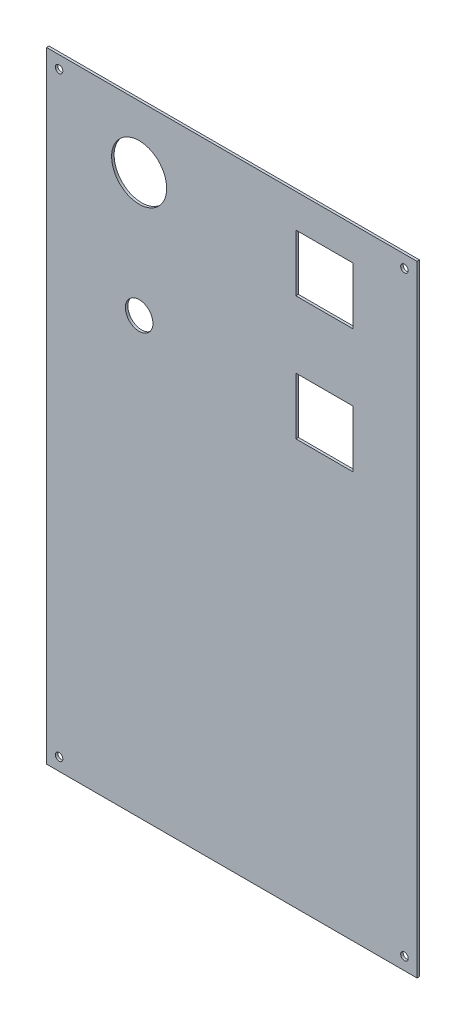
ISO-10303-21;
HEADER;
FILE_DESCRIPTION(('STEP AP214'),'2;1');
FILE_NAME('part.step','',(''),(''),'','','');
FILE_SCHEMA(('AUTOMOTIVE_DESIGN { 1 0 10303 214 1 1 1 1 }'));
ENDSEC;
DATA;
#1=APPLICATION_CONTEXT('core data for automotive mechanical design processes');
#2=APPLICATION_PROTOCOL_DEFINITION('international standard','automotive_design',2000,#1);
#3=PRODUCT_CONTEXT('',#1,'mechanical');
#4=PRODUCT('Part','Part','',(#3));
#5=PRODUCT_RELATED_PRODUCT_CATEGORY('part','',(#4));
#6=PRODUCT_DEFINITION_FORMATION('','',#4);
#7=PRODUCT_DEFINITION_CONTEXT('part definition',#1,'design');
#8=PRODUCT_DEFINITION('design','',#6,#7);
#9=PRODUCT_DEFINITION_SHAPE('','',#8);
#10=(LENGTH_UNIT() NAMED_UNIT(*) SI_UNIT(.MILLI.,.METRE.));
#11=(NAMED_UNIT(*) PLANE_ANGLE_UNIT() SI_UNIT($,.RADIAN.));
#12=(NAMED_UNIT(*) SI_UNIT($,.STERADIAN.) SOLID_ANGLE_UNIT());
#13=UNCERTAINTY_MEASURE_WITH_UNIT(LENGTH_MEASURE(1.E-05),#10,'distance_accuracy_value','');
#14=(GEOMETRIC_REPRESENTATION_CONTEXT(3) GLOBAL_UNCERTAINTY_ASSIGNED_CONTEXT((#13)) GLOBAL_UNIT_ASSIGNED_CONTEXT((#10,
#11,#12)) REPRESENTATION_CONTEXT('',''));
#15=CARTESIAN_POINT('',(0.,0.,0.));
#16=DIRECTION('',(0.,0.,1.));
#17=DIRECTION('',(1.,0.,0.));
#18=AXIS2_PLACEMENT_3D('',#15,#16,#17);
#19=CARTESIAN_POINT('',(0.,0.,0.));
#20=DIRECTION('',(0.,0.,-1.));
#21=DIRECTION('',(0.,1.,0.));
#22=AXIS2_PLACEMENT_3D('',#19,#20,#21);
#23=PLANE('',#22);
#24=CARTESIAN_POINT('',(138.,-238.,0.));
#25=DIRECTION('',(0.,0.,-1.));
#26=DIRECTION('',(0.,1.,0.));
#27=AXIS2_PLACEMENT_3D('',#24,#25,#26);
#28=CIRCLE('',#27,3.00000000000003);
#29=CARTESIAN_POINT('',(138.,-235.,0.));
#30=VERTEX_POINT('',#29);
#31=EDGE_CURVE('E147',#30,#30,#28,.F.);
#32=ORIENTED_EDGE('',*,*,#31,.T.);
#33=EDGE_LOOP('',(#32));
#34=FACE_BOUND('',#33,.T.);
#35=CARTESIAN_POINT('',(138.000000000001,238.,0.));
#36=DIRECTION('',(0.,0.,-1.));
#37=DIRECTION('',(0.,1.,0.));
#38=AXIS2_PLACEMENT_3D('',#35,#36,#37);
#39=CIRCLE('',#38,3.00000000000003);
#40=CARTESIAN_POINT('',(138.000000000001,241.,0.));
#41=VERTEX_POINT('',#40);
#42=EDGE_CURVE('E153',#41,#41,#39,.F.);
#43=ORIENTED_EDGE('',*,*,#42,.T.);
#44=EDGE_LOOP('',(#43));
#45=FACE_BOUND('',#44,.T.);
#46=CARTESIAN_POINT('',(-74.,198.5,0.));
#47=DIRECTION('',(0.,0.,-1.));
#48=DIRECTION('',(0.,1.,0.));
#49=AXIS2_PLACEMENT_3D('',#46,#47,#48);
#50=CIRCLE('',#49,22.0000000000002);
#51=CARTESIAN_POINT('',(-74.,220.5,0.));
#52=VERTEX_POINT('',#51);
#53=EDGE_CURVE('E158',#52,#52,#50,.F.);
#54=ORIENTED_EDGE('',*,*,#53,.T.);
#55=EDGE_LOOP('',(#54));
#56=FACE_BOUND('',#55,.T.);
#57=DIRECTION('',(1.,0.,0.));
#58=VECTOR('',#57,1.);
#59=CARTESIAN_POINT('',(51.2500000000006,122.25,0.));
#60=LINE('',#59,#58);
#61=CARTESIAN_POINT('',(51.2500000000004,122.25,0.));
#62=VERTEX_POINT('',#61);
#63=CARTESIAN_POINT('',(96.7500000000009,122.25,0.));
#64=VERTEX_POINT('',#63);
#65=EDGE_CURVE('E184',#62,#64,#60,.T.);
#66=ORIENTED_EDGE('',*,*,#65,.F.);
#67=DIRECTION('',(0.,1.,0.));
#68=VECTOR('',#67,1.);
#69=CARTESIAN_POINT('',(51.2500000000003,76.75,0.));
#70=LINE('',#69,#68);
#71=CARTESIAN_POINT('',(51.2500000000004,76.75,0.));
#72=VERTEX_POINT('',#71);
#73=EDGE_CURVE('E182',#72,#62,#70,.T.);
#74=ORIENTED_EDGE('',*,*,#73,.F.);
#75=DIRECTION('',(-1.,0.,0.));
#76=VECTOR('',#75,1.);
#77=CARTESIAN_POINT('',(51.2500000000003,76.75,0.));
#78=LINE('',#77,#76);
#79=CARTESIAN_POINT('',(96.7500000000009,76.7499999999999,0.));
#80=VERTEX_POINT('',#79);
#81=EDGE_CURVE('E178',#80,#72,#78,.T.);
#82=ORIENTED_EDGE('',*,*,#81,.F.);
#83=DIRECTION('',(0.,-1.,0.));
#84=VECTOR('',#83,1.);
#85=CARTESIAN_POINT('',(96.7500000000009,76.75,0.));
#86=LINE('',#85,#84);
#87=EDGE_CURVE('E170',#64,#80,#86,.T.);
#88=ORIENTED_EDGE('',*,*,#87,.F.);
#89=EDGE_LOOP('',(#66,#74,#82,#88));
#90=FACE_BOUND('',#89,.T.);
#91=DIRECTION('',(1.,0.,0.));
#92=VECTOR('',#91,1.);
#93=CARTESIAN_POINT('',(51.2500000000006,221.25,0.));
#94=LINE('',#93,#92);
#95=CARTESIAN_POINT('',(51.2500000000006,221.25,0.));
#96=VERTEX_POINT('',#95);
#97=CARTESIAN_POINT('',(96.7500000000014,221.25,0.));
#98=VERTEX_POINT('',#97);
#99=EDGE_CURVE('E116',#96,#98,#94,.T.);
#100=ORIENTED_EDGE('',*,*,#99,.F.);
#101=DIRECTION('',(0.,1.,0.));
#102=VECTOR('',#101,1.);
#103=CARTESIAN_POINT('',(51.2500000000006,221.25,0.));
#104=LINE('',#103,#102);
#105=CARTESIAN_POINT('',(51.2500000000006,175.75,0.));
#106=VERTEX_POINT('',#105);
#107=EDGE_CURVE('E107',#106,#96,#104,.T.);
#108=ORIENTED_EDGE('',*,*,#107,.F.);
#109=DIRECTION('',(-1.,0.,0.));
#110=VECTOR('',#109,1.);
#111=CARTESIAN_POINT('',(51.2500000000006,175.75,0.));
#112=LINE('',#111,#110);
#113=CARTESIAN_POINT('',(96.7500000000015,175.75,0.));
#114=VERTEX_POINT('',#113);
#115=EDGE_CURVE('E102',#114,#106,#112,.T.);
#116=ORIENTED_EDGE('',*,*,#115,.F.);
#117=DIRECTION('',(0.,-1.,0.));
#118=VECTOR('',#117,1.);
#119=CARTESIAN_POINT('',(96.7500000000014,221.25,0.));
#120=LINE('',#119,#118);
#121=EDGE_CURVE('E120',#98,#114,#120,.T.);
#122=ORIENTED_EDGE('',*,*,#121,.F.);
#123=EDGE_LOOP('',(#100,#108,#116,#122));
#124=FACE_BOUND('',#123,.T.);
#125=DIRECTION('',(0.,-1.,0.));
#126=VECTOR('',#125,1.);
#127=CARTESIAN_POINT('',(148.000000000002,248.,0.));
#128=LINE('',#127,#126);
#129=CARTESIAN_POINT('',(148.000000000002,248.,0.));
#130=VERTEX_POINT('',#129);
#131=CARTESIAN_POINT('',(148.,-248.,0.));
#132=VERTEX_POINT('',#131);
#133=EDGE_CURVE('E200',#130,#132,#128,.T.);
#134=ORIENTED_EDGE('',*,*,#133,.T.);
#135=DIRECTION('',(-1.,0.,0.));
#136=VECTOR('',#135,1.);
#137=CARTESIAN_POINT('',(148.,-248.,0.));
#138=LINE('',#137,#136);
#139=CARTESIAN_POINT('',(-148.000000000003,-248.,0.));
#140=VERTEX_POINT('',#139);
#141=EDGE_CURVE('E195',#132,#140,#138,.T.);
#142=ORIENTED_EDGE('',*,*,#141,.T.);
#143=DIRECTION('',(0.,1.,0.));
#144=VECTOR('',#143,1.);
#145=CARTESIAN_POINT('',(-148.000000000002,248.,0.));
#146=LINE('',#145,#144);
#147=CARTESIAN_POINT('',(-148.000000000002,247.999999999999,0.));
#148=VERTEX_POINT('',#147);
#149=EDGE_CURVE('E186',#140,#148,#146,.T.);
#150=ORIENTED_EDGE('',*,*,#149,.T.);
#151=DIRECTION('',(1.,0.,0.));
#152=VECTOR('',#151,1.);
#153=CARTESIAN_POINT('',(148.000000000002,248.,0.));
#154=LINE('',#153,#152);
#155=EDGE_CURVE('E205',#148,#130,#154,.T.);
#156=ORIENTED_EDGE('',*,*,#155,.T.);
#157=EDGE_LOOP('',(#134,#142,#150,#156));
#158=FACE_BOUND('',#157,.T.);
#159=CARTESIAN_POINT('',(-74.,99.4999999999999,0.));
#160=DIRECTION('',(0.,0.,-1.));
#161=DIRECTION('',(0.,1.,0.));
#162=AXIS2_PLACEMENT_3D('',#159,#160,#161);
#163=CIRCLE('',#162,11.0000000000001);
#164=CARTESIAN_POINT('',(-74.,110.5,0.));
#165=VERTEX_POINT('',#164);
#166=EDGE_CURVE('E19',#165,#165,#163,.F.);
#167=ORIENTED_EDGE('',*,*,#166,.T.);
#168=EDGE_LOOP('',(#167));
#169=FACE_BOUND('',#168,.T.);
#170=CARTESIAN_POINT('',(-138.000000000002,238.,0.));
#171=DIRECTION('',(0.,0.,-1.));
#172=DIRECTION('',(0.,1.,0.));
#173=AXIS2_PLACEMENT_3D('',#170,#171,#172);
#174=CIRCLE('',#173,3.00000000000003);
#175=CARTESIAN_POINT('',(-138.000000000002,241.,0.));
#176=VERTEX_POINT('',#175);
#177=EDGE_CURVE('E156',#176,#176,#174,.F.);
#178=ORIENTED_EDGE('',*,*,#177,.T.);
#179=EDGE_LOOP('',(#178));
#180=FACE_BOUND('',#179,.T.);
#181=CARTESIAN_POINT('',(-138.000000000003,-238.,0.));
#182=DIRECTION('',(0.,0.,-1.));
#183=DIRECTION('',(0.,1.,0.));
#184=AXIS2_PLACEMENT_3D('',#181,#182,#183);
#185=CIRCLE('',#184,3.00000000000003);
#186=CARTESIAN_POINT('',(-138.000000000003,-235.,0.));
#187=VERTEX_POINT('',#186);
#188=EDGE_CURVE('E150',#187,#187,#185,.F.);
#189=ORIENTED_EDGE('',*,*,#188,.T.);
#190=EDGE_LOOP('',(#189));
#191=FACE_BOUND('',#190,.T.);
#192=ADVANCED_FACE('F16',(#34,#45,#56,#90,#124,#158,#169,#180,#191),#23,.T.);
#193=CARTESIAN_POINT('',(51.2500000000006,221.25,2.));
#194=DIRECTION('',(0.,-1.,0.));
#195=DIRECTION('',(1.,0.,0.));
#196=AXIS2_PLACEMENT_3D('',#193,#194,#195);
#197=PLANE('',#196);
#198=DIRECTION('',(1.,0.,0.));
#199=VECTOR('',#198,1.);
#200=CARTESIAN_POINT('',(0.,221.25,2.));
#201=LINE('',#200,#199);
#202=CARTESIAN_POINT('',(96.7500000000014,221.25,2.));
#203=VERTEX_POINT('',#202);
#204=CARTESIAN_POINT('',(51.2500000000006,221.25,2.));
#205=VERTEX_POINT('',#204);
#206=EDGE_CURVE('E127',#203,#205,#201,.F.);
#207=ORIENTED_EDGE('',*,*,#206,.T.);
#208=DIRECTION('',(0.,0.,1.));
#209=VECTOR('',#208,1.);
#210=CARTESIAN_POINT('',(51.2500000000006,221.25,2.));
#211=LINE('',#210,#209);
#212=EDGE_CURVE('E112',#96,#205,#211,.T.);
#213=ORIENTED_EDGE('',*,*,#212,.F.);
#214=ORIENTED_EDGE('',*,*,#99,.T.);
#215=DIRECTION('',(0.,0.,1.));
#216=VECTOR('',#215,1.);
#217=CARTESIAN_POINT('',(96.7500000000014,221.25,2.));
#218=LINE('',#217,#216);
#219=EDGE_CURVE('E207',#203,#98,#218,.F.);
#220=ORIENTED_EDGE('',*,*,#219,.F.);
#221=EDGE_LOOP('',(#207,#213,#214,#220));
#222=FACE_BOUND('',#221,.T.);
#223=ADVANCED_FACE('F126',(#222),#197,.T.);
#224=CARTESIAN_POINT('',(51.2500000000006,221.25,2.));
#225=DIRECTION('',(1.,0.,0.));
#226=DIRECTION('',(0.,1.,0.));
#227=AXIS2_PLACEMENT_3D('',#224,#225,#226);
#228=PLANE('',#227);
#229=DIRECTION('',(0.,1.,0.));
#230=VECTOR('',#229,1.);
#231=CARTESIAN_POINT('',(51.2500000000006,0.,2.));
#232=LINE('',#231,#230);
#233=CARTESIAN_POINT('',(51.2500000000007,175.75,2.));
#234=VERTEX_POINT('',#233);
#235=EDGE_CURVE('E218',#205,#234,#232,.F.);
#236=ORIENTED_EDGE('',*,*,#235,.T.);
#237=DIRECTION('',(0.,0.,1.));
#238=VECTOR('',#237,1.);
#239=CARTESIAN_POINT('',(51.2500000000006,175.75,2.));
#240=LINE('',#239,#238);
#241=EDGE_CURVE('E114',#106,#234,#240,.T.);
#242=ORIENTED_EDGE('',*,*,#241,.F.);
#243=ORIENTED_EDGE('',*,*,#107,.T.);
#244=ORIENTED_EDGE('',*,*,#212,.T.);
#245=EDGE_LOOP('',(#236,#242,#243,#244));
#246=FACE_BOUND('',#245,.T.);
#247=ADVANCED_FACE('F110',(#246),#228,.T.);
#248=CARTESIAN_POINT('',(51.2500000000006,175.75,2.));
#249=DIRECTION('',(0.,1.,0.));
#250=DIRECTION('',(-1.,0.,0.));
#251=AXIS2_PLACEMENT_3D('',#248,#249,#250);
#252=PLANE('',#251);
#253=DIRECTION('',(1.,0.,0.));
#254=VECTOR('',#253,1.);
#255=CARTESIAN_POINT('',(0.,175.75,2.));
#256=LINE('',#255,#254);
#257=CARTESIAN_POINT('',(96.7500000000015,175.75,2.));
#258=VERTEX_POINT('',#257);
#259=EDGE_CURVE('E214',#234,#258,#256,.T.);
#260=ORIENTED_EDGE('',*,*,#259,.T.);
#261=DIRECTION('',(0.,0.,1.));
#262=VECTOR('',#261,1.);
#263=CARTESIAN_POINT('',(96.7500000000016,175.75,2.));
#264=LINE('',#263,#262);
#265=EDGE_CURVE('E209',#114,#258,#264,.T.);
#266=ORIENTED_EDGE('',*,*,#265,.F.);
#267=ORIENTED_EDGE('',*,*,#115,.T.);
#268=ORIENTED_EDGE('',*,*,#241,.T.);
#269=EDGE_LOOP('',(#260,#266,#267,#268));
#270=FACE_BOUND('',#269,.T.);
#271=ADVANCED_FACE('F213',(#270),#252,.T.);
#272=CARTESIAN_POINT('',(96.7500000000014,221.25,2.));
#273=DIRECTION('',(-1.,0.,0.));
#274=DIRECTION('',(0.,-1.,0.));
#275=AXIS2_PLACEMENT_3D('',#272,#273,#274);
#276=PLANE('',#275);
#277=DIRECTION('',(0.,1.,0.));
#278=VECTOR('',#277,1.);
#279=CARTESIAN_POINT('',(96.7500000000014,0.,2.));
#280=LINE('',#279,#278);
#281=EDGE_CURVE('E220',#258,#203,#280,.T.);
#282=ORIENTED_EDGE('',*,*,#281,.T.);
#283=ORIENTED_EDGE('',*,*,#219,.T.);
#284=ORIENTED_EDGE('',*,*,#121,.T.);
#285=ORIENTED_EDGE('',*,*,#265,.T.);
#286=EDGE_LOOP('',(#282,#283,#284,#285));
#287=FACE_BOUND('',#286,.T.);
#288=ADVANCED_FACE('F324',(#287),#276,.T.);
#289=CARTESIAN_POINT('',(148.000000000002,248.,2.));
#290=DIRECTION('',(0.,-1.,0.));
#291=DIRECTION('',(1.,0.,0.));
#292=AXIS2_PLACEMENT_3D('',#289,#290,#291);
#293=PLANE('',#292);
#294=DIRECTION('',(0.,0.,1.));
#295=VECTOR('',#294,1.);
#296=CARTESIAN_POINT('',(-148.000000000002,248.,2.));
#297=LINE('',#296,#295);
#298=CARTESIAN_POINT('',(-148.000000000002,247.999999999999,2.));
#299=VERTEX_POINT('',#298);
#300=EDGE_CURVE('E192',#148,#299,#297,.T.);
#301=ORIENTED_EDGE('',*,*,#300,.T.);
#302=DIRECTION('',(1.,0.,0.));
#303=VECTOR('',#302,1.);
#304=CARTESIAN_POINT('',(0.,248.,2.));
#305=LINE('',#304,#303);
#306=CARTESIAN_POINT('',(148.000000000002,248.,2.));
#307=VERTEX_POINT('',#306);
#308=EDGE_CURVE('E224',#299,#307,#305,.T.);
#309=ORIENTED_EDGE('',*,*,#308,.T.);
#310=DIRECTION('',(0.,0.,1.));
#311=VECTOR('',#310,1.);
#312=CARTESIAN_POINT('',(148.000000000002,248.,2.));
#313=LINE('',#312,#311);
#314=EDGE_CURVE('E202',#307,#130,#313,.F.);
#315=ORIENTED_EDGE('',*,*,#314,.T.);
#316=ORIENTED_EDGE('',*,*,#155,.F.);
#317=EDGE_LOOP('',(#301,#309,#315,#316));
#318=FACE_BOUND('',#317,.T.);
#319=ADVANCED_FACE('F320',(#318),#293,.F.);
#320=CARTESIAN_POINT('',(148.000000000002,248.,2.));
#321=DIRECTION('',(-1.,0.,0.));
#322=DIRECTION('',(0.,-1.,0.));
#323=AXIS2_PLACEMENT_3D('',#320,#321,#322);
#324=PLANE('',#323);
#325=ORIENTED_EDGE('',*,*,#314,.F.);
#326=DIRECTION('',(0.,1.,0.));
#327=VECTOR('',#326,1.);
#328=CARTESIAN_POINT('',(148.000000000002,0.,2.));
#329=LINE('',#328,#327);
#330=CARTESIAN_POINT('',(148.,-248.,2.));
#331=VERTEX_POINT('',#330);
#332=EDGE_CURVE('E227',#307,#331,#329,.F.);
#333=ORIENTED_EDGE('',*,*,#332,.T.);
#334=DIRECTION('',(0.,0.,1.));
#335=VECTOR('',#334,1.);
#336=CARTESIAN_POINT('',(148.,-248.,2.));
#337=LINE('',#336,#335);
#338=EDGE_CURVE('E197',#331,#132,#337,.F.);
#339=ORIENTED_EDGE('',*,*,#338,.T.);
#340=ORIENTED_EDGE('',*,*,#133,.F.);
#341=EDGE_LOOP('',(#325,#333,#339,#340));
#342=FACE_BOUND('',#341,.T.);
#343=ADVANCED_FACE('F316',(#342),#324,.F.);
#344=CARTESIAN_POINT('',(148.,-248.,2.));
#345=DIRECTION('',(0.,1.,0.));
#346=DIRECTION('',(-1.,0.,0.));
#347=AXIS2_PLACEMENT_3D('',#344,#345,#346);
#348=PLANE('',#347);
#349=ORIENTED_EDGE('',*,*,#338,.F.);
#350=DIRECTION('',(1.,0.,0.));
#351=VECTOR('',#350,1.);
#352=CARTESIAN_POINT('',(0.,-248.,2.));
#353=LINE('',#352,#351);
#354=CARTESIAN_POINT('',(-148.000000000003,-248.,2.));
#355=VERTEX_POINT('',#354);
#356=EDGE_CURVE('E230',#331,#355,#353,.F.);
#357=ORIENTED_EDGE('',*,*,#356,.T.);
#358=DIRECTION('',(0.,0.,1.));
#359=VECTOR('',#358,1.);
#360=CARTESIAN_POINT('',(-148.000000000003,-248.,2.));
#361=LINE('',#360,#359);
#362=EDGE_CURVE('E189',#355,#140,#361,.F.);
#363=ORIENTED_EDGE('',*,*,#362,.T.);
#364=ORIENTED_EDGE('',*,*,#141,.F.);
#365=EDGE_LOOP('',(#349,#357,#363,#364));
#366=FACE_BOUND('',#365,.T.);
#367=ADVANCED_FACE('F312',(#366),#348,.F.);
#368=CARTESIAN_POINT('',(-148.000000000002,248.,2.));
#369=DIRECTION('',(1.,0.,0.));
#370=DIRECTION('',(0.,1.,0.));
#371=AXIS2_PLACEMENT_3D('',#368,#369,#370);
#372=PLANE('',#371);
#373=ORIENTED_EDGE('',*,*,#362,.F.);
#374=DIRECTION('',(0.,1.,0.));
#375=VECTOR('',#374,1.);
#376=CARTESIAN_POINT('',(-148.000000000002,0.,2.));
#377=LINE('',#376,#375);
#378=EDGE_CURVE('E233',#355,#299,#377,.T.);
#379=ORIENTED_EDGE('',*,*,#378,.T.);
#380=ORIENTED_EDGE('',*,*,#300,.F.);
#381=ORIENTED_EDGE('',*,*,#149,.F.);
#382=EDGE_LOOP('',(#373,#379,#380,#381));
#383=FACE_BOUND('',#382,.T.);
#384=ADVANCED_FACE('F309',(#383),#372,.F.);
#385=CARTESIAN_POINT('',(51.2500000000006,122.25,2.));
#386=DIRECTION('',(0.,-1.,0.));
#387=DIRECTION('',(1.,0.,0.));
#388=AXIS2_PLACEMENT_3D('',#385,#386,#387);
#389=PLANE('',#388);
#390=DIRECTION('',(1.,0.,0.));
#391=VECTOR('',#390,1.);
#392=CARTESIAN_POINT('',(0.,122.25,2.));
#393=LINE('',#392,#391);
#394=CARTESIAN_POINT('',(96.750000000001,122.25,2.));
#395=VERTEX_POINT('',#394);
#396=CARTESIAN_POINT('',(51.2500000000005,122.25,2.));
#397=VERTEX_POINT('',#396);
#398=EDGE_CURVE('E236',#395,#397,#393,.F.);
#399=ORIENTED_EDGE('',*,*,#398,.T.);
#400=DIRECTION('',(0.,0.,1.));
#401=VECTOR('',#400,1.);
#402=CARTESIAN_POINT('',(51.2500000000001,122.25,2.));
#403=LINE('',#402,#401);
#404=EDGE_CURVE('E180',#62,#397,#403,.T.);
#405=ORIENTED_EDGE('',*,*,#404,.F.);
#406=ORIENTED_EDGE('',*,*,#65,.T.);
#407=DIRECTION('',(0.,0.,1.));
#408=VECTOR('',#407,1.);
#409=CARTESIAN_POINT('',(96.7500000000007,122.25,2.));
#410=LINE('',#409,#408);
#411=EDGE_CURVE('E163',#395,#64,#410,.F.);
#412=ORIENTED_EDGE('',*,*,#411,.F.);
#413=EDGE_LOOP('',(#399,#405,#406,#412));
#414=FACE_BOUND('',#413,.T.);
#415=ADVANCED_FACE('F260',(#414),#389,.T.);
#416=CARTESIAN_POINT('',(51.2500000000003,76.75,2.));
#417=DIRECTION('',(1.,0.,0.));
#418=DIRECTION('',(0.,1.,0.));
#419=AXIS2_PLACEMENT_3D('',#416,#417,#418);
#420=PLANE('',#419);
#421=DIRECTION('',(0.,1.,0.));
#422=VECTOR('',#421,1.);
#423=CARTESIAN_POINT('',(51.2500000000006,0.,2.));
#424=LINE('',#423,#422);
#425=CARTESIAN_POINT('',(51.2500000000004,76.75,2.));
#426=VERTEX_POINT('',#425);
#427=EDGE_CURVE('E239',#397,#426,#424,.F.);
#428=ORIENTED_EDGE('',*,*,#427,.T.);
#429=DIRECTION('',(0.,0.,1.));
#430=VECTOR('',#429,1.);
#431=CARTESIAN_POINT('',(51.2500000000003,76.75,2.));
#432=LINE('',#431,#430);
#433=EDGE_CURVE('E176',#72,#426,#432,.T.);
#434=ORIENTED_EDGE('',*,*,#433,.F.);
#435=ORIENTED_EDGE('',*,*,#73,.T.);
#436=ORIENTED_EDGE('',*,*,#404,.T.);
#437=EDGE_LOOP('',(#428,#434,#435,#436));
#438=FACE_BOUND('',#437,.T.);
#439=ADVANCED_FACE('F256',(#438),#420,.T.);
#440=CARTESIAN_POINT('',(51.2500000000003,76.75,2.));
#441=DIRECTION('',(0.,1.,0.));
#442=DIRECTION('',(-1.,0.,0.));
#443=AXIS2_PLACEMENT_3D('',#440,#441,#442);
#444=PLANE('',#443);
#445=DIRECTION('',(1.,0.,0.));
#446=VECTOR('',#445,1.);
#447=CARTESIAN_POINT('',(0.,76.75,2.));
#448=LINE('',#447,#446);
#449=CARTESIAN_POINT('',(96.7500000000009,76.7499999999999,2.));
#450=VERTEX_POINT('',#449);
#451=EDGE_CURVE('E242',#426,#450,#448,.T.);
#452=ORIENTED_EDGE('',*,*,#451,.T.);
#453=DIRECTION('',(0.,0.,1.));
#454=VECTOR('',#453,1.);
#455=CARTESIAN_POINT('',(96.7500000000009,76.75,2.));
#456=LINE('',#455,#454);
#457=EDGE_CURVE('E34',#80,#450,#456,.T.);
#458=ORIENTED_EDGE('',*,*,#457,.F.);
#459=ORIENTED_EDGE('',*,*,#81,.T.);
#460=ORIENTED_EDGE('',*,*,#433,.T.);
#461=EDGE_LOOP('',(#452,#458,#459,#460));
#462=FACE_BOUND('',#461,.T.);
#463=ADVANCED_FACE('F251',(#462),#444,.T.);
#464=CARTESIAN_POINT('',(96.7500000000009,76.75,2.));
#465=DIRECTION('',(-1.,0.,0.));
#466=DIRECTION('',(0.,-1.,0.));
#467=AXIS2_PLACEMENT_3D('',#464,#465,#466);
#468=PLANE('',#467);
#469=DIRECTION('',(0.,1.,0.));
#470=VECTOR('',#469,1.);
#471=CARTESIAN_POINT('',(96.7500000000009,0.,2.));
#472=LINE('',#471,#470);
#473=EDGE_CURVE('E146',#450,#395,#472,.T.);
#474=ORIENTED_EDGE('',*,*,#473,.T.);
#475=ORIENTED_EDGE('',*,*,#411,.T.);
#476=ORIENTED_EDGE('',*,*,#87,.T.);
#477=ORIENTED_EDGE('',*,*,#457,.T.);
#478=EDGE_LOOP('',(#474,#475,#476,#477));
#479=FACE_BOUND('',#478,.T.);
#480=ADVANCED_FACE('F245',(#479),#468,.T.);
#481=CARTESIAN_POINT('',(-74.,99.4999999999999,2.));
#482=DIRECTION('',(0.,0.,-1.));
#483=DIRECTION('',(0.,1.,0.));
#484=AXIS2_PLACEMENT_3D('',#481,#482,#483);
#485=CYLINDRICAL_SURFACE('',#484,11.0000000000001);
#486=ORIENTED_EDGE('',*,*,#166,.F.);
#487=EDGE_LOOP('',(#486));
#488=FACE_BOUND('',#487,.T.);
#489=CARTESIAN_POINT('',(-74.,99.4999999999999,2.));
#490=DIRECTION('',(0.,0.,-1.));
#491=DIRECTION('',(0.,1.,0.));
#492=AXIS2_PLACEMENT_3D('',#489,#490,#491);
#493=CIRCLE('',#492,11.0000000000001);
#494=CARTESIAN_POINT('',(-74.,110.5,2.));
#495=VERTEX_POINT('',#494);
#496=EDGE_CURVE('E143',#495,#495,#493,.F.);
#497=ORIENTED_EDGE('',*,*,#496,.T.);
#498=EDGE_LOOP('',(#497));
#499=FACE_BOUND('',#498,.T.);
#500=ADVANCED_FACE('F296',(#488,#499),#485,.F.);
#501=CARTESIAN_POINT('',(-74.,198.5,2.));
#502=DIRECTION('',(0.,0.,-1.));
#503=DIRECTION('',(0.,1.,0.));
#504=AXIS2_PLACEMENT_3D('',#501,#502,#503);
#505=CYLINDRICAL_SURFACE('',#504,22.0000000000002);
#506=ORIENTED_EDGE('',*,*,#53,.F.);
#507=EDGE_LOOP('',(#506));
#508=FACE_BOUND('',#507,.T.);
#509=CARTESIAN_POINT('',(-74.,198.5,2.));
#510=DIRECTION('',(0.,0.,-1.));
#511=DIRECTION('',(0.,1.,0.));
#512=AXIS2_PLACEMENT_3D('',#509,#510,#511);
#513=CIRCLE('',#512,22.0000000000002);
#514=CARTESIAN_POINT('',(-74.,220.5,2.));
#515=VERTEX_POINT('',#514);
#516=EDGE_CURVE('E140',#515,#515,#513,.F.);
#517=ORIENTED_EDGE('',*,*,#516,.T.);
#518=EDGE_LOOP('',(#517));
#519=FACE_BOUND('',#518,.T.);
#520=ADVANCED_FACE('F292',(#508,#519),#505,.F.);
#521=CARTESIAN_POINT('',(-138.000000000002,238.,2.));
#522=DIRECTION('',(0.,0.,-1.));
#523=DIRECTION('',(0.,1.,0.));
#524=AXIS2_PLACEMENT_3D('',#521,#522,#523);
#525=CYLINDRICAL_SURFACE('',#524,3.00000000000003);
#526=ORIENTED_EDGE('',*,*,#177,.F.);
#527=EDGE_LOOP('',(#526));
#528=FACE_BOUND('',#527,.T.);
#529=CARTESIAN_POINT('',(-138.000000000002,238.,2.));
#530=DIRECTION('',(0.,0.,-1.));
#531=DIRECTION('',(0.,1.,0.));
#532=AXIS2_PLACEMENT_3D('',#529,#530,#531);
#533=CIRCLE('',#532,3.00000000000003);
#534=CARTESIAN_POINT('',(-138.000000000002,241.,2.));
#535=VERTEX_POINT('',#534);
#536=EDGE_CURVE('E137',#535,#535,#533,.F.);
#537=ORIENTED_EDGE('',*,*,#536,.T.);
#538=EDGE_LOOP('',(#537));
#539=FACE_BOUND('',#538,.T.);
#540=ADVANCED_FACE('F288',(#528,#539),#525,.F.);
#541=CARTESIAN_POINT('',(138.000000000001,238.,2.));
#542=DIRECTION('',(0.,0.,-1.));
#543=DIRECTION('',(0.,1.,0.));
#544=AXIS2_PLACEMENT_3D('',#541,#542,#543);
#545=CYLINDRICAL_SURFACE('',#544,3.00000000000003);
#546=ORIENTED_EDGE('',*,*,#42,.F.);
#547=EDGE_LOOP('',(#546));
#548=FACE_BOUND('',#547,.T.);
#549=CARTESIAN_POINT('',(138.000000000001,238.,2.));
#550=DIRECTION('',(0.,0.,-1.));
#551=DIRECTION('',(0.,1.,0.));
#552=AXIS2_PLACEMENT_3D('',#549,#550,#551);
#553=CIRCLE('',#552,3.00000000000003);
#554=CARTESIAN_POINT('',(138.000000000001,241.,2.));
#555=VERTEX_POINT('',#554);
#556=EDGE_CURVE('E134',#555,#555,#553,.F.);
#557=ORIENTED_EDGE('',*,*,#556,.T.);
#558=EDGE_LOOP('',(#557));
#559=FACE_BOUND('',#558,.T.);
#560=ADVANCED_FACE('F284',(#548,#559),#545,.F.);
#561=CARTESIAN_POINT('',(-138.000000000003,-238.,2.));
#562=DIRECTION('',(0.,0.,-1.));
#563=DIRECTION('',(0.,1.,0.));
#564=AXIS2_PLACEMENT_3D('',#561,#562,#563);
#565=CYLINDRICAL_SURFACE('',#564,3.00000000000003);
#566=ORIENTED_EDGE('',*,*,#188,.F.);
#567=EDGE_LOOP('',(#566));
#568=FACE_BOUND('',#567,.T.);
#569=CARTESIAN_POINT('',(-138.000000000003,-238.,2.));
#570=DIRECTION('',(0.,0.,-1.));
#571=DIRECTION('',(0.,1.,0.));
#572=AXIS2_PLACEMENT_3D('',#569,#570,#571);
#573=CIRCLE('',#572,3.00000000000003);
#574=CARTESIAN_POINT('',(-138.000000000003,-235.,2.));
#575=VERTEX_POINT('',#574);
#576=EDGE_CURVE('E25',#575,#575,#573,.F.);
#577=ORIENTED_EDGE('',*,*,#576,.T.);
#578=EDGE_LOOP('',(#577));
#579=FACE_BOUND('',#578,.T.);
#580=ADVANCED_FACE('F276',(#568,#579),#565,.F.);
#581=CARTESIAN_POINT('',(138.,-238.,2.));
#582=DIRECTION('',(0.,0.,-1.));
#583=DIRECTION('',(0.,1.,0.));
#584=AXIS2_PLACEMENT_3D('',#581,#582,#583);
#585=CYLINDRICAL_SURFACE('',#584,3.00000000000003);
#586=ORIENTED_EDGE('',*,*,#31,.F.);
#587=EDGE_LOOP('',(#586));
#588=FACE_BOUND('',#587,.T.);
#589=CARTESIAN_POINT('',(138.,-238.,2.));
#590=DIRECTION('',(0.,0.,-1.));
#591=DIRECTION('',(0.,1.,0.));
#592=AXIS2_PLACEMENT_3D('',#589,#590,#591);
#593=CIRCLE('',#592,3.00000000000003);
#594=CARTESIAN_POINT('',(138.,-235.,2.));
#595=VERTEX_POINT('',#594);
#596=EDGE_CURVE('E11',#595,#595,#593,.F.);
#597=ORIENTED_EDGE('',*,*,#596,.T.);
#598=EDGE_LOOP('',(#597));
#599=FACE_BOUND('',#598,.T.);
#600=ADVANCED_FACE('F270',(#588,#599),#585,.F.);
#601=CARTESIAN_POINT('',(0.,0.,2.));
#602=DIRECTION('',(0.,0.,-1.));
#603=DIRECTION('',(0.,1.,0.));
#604=AXIS2_PLACEMENT_3D('',#601,#602,#603);
#605=PLANE('',#604);
#606=ORIENTED_EDGE('',*,*,#596,.F.);
#607=EDGE_LOOP('',(#606));
#608=FACE_BOUND('',#607,.T.);
#609=ORIENTED_EDGE('',*,*,#576,.F.);
#610=EDGE_LOOP('',(#609));
#611=FACE_BOUND('',#610,.T.);
#612=ORIENTED_EDGE('',*,*,#556,.F.);
#613=EDGE_LOOP('',(#612));
#614=FACE_BOUND('',#613,.T.);
#615=ORIENTED_EDGE('',*,*,#536,.F.);
#616=EDGE_LOOP('',(#615));
#617=FACE_BOUND('',#616,.T.);
#618=ORIENTED_EDGE('',*,*,#516,.F.);
#619=EDGE_LOOP('',(#618));
#620=FACE_BOUND('',#619,.T.);
#621=ORIENTED_EDGE('',*,*,#496,.F.);
#622=EDGE_LOOP('',(#621));
#623=FACE_BOUND('',#622,.T.);
#624=ORIENTED_EDGE('',*,*,#451,.F.);
#625=ORIENTED_EDGE('',*,*,#427,.F.);
#626=ORIENTED_EDGE('',*,*,#398,.F.);
#627=ORIENTED_EDGE('',*,*,#473,.F.);
#628=EDGE_LOOP('',(#624,#625,#626,#627));
#629=FACE_BOUND('',#628,.T.);
#630=ORIENTED_EDGE('',*,*,#356,.F.);
#631=ORIENTED_EDGE('',*,*,#332,.F.);
#632=ORIENTED_EDGE('',*,*,#308,.F.);
#633=ORIENTED_EDGE('',*,*,#378,.F.);
#634=EDGE_LOOP('',(#630,#631,#632,#633));
#635=FACE_BOUND('',#634,.T.);
#636=ORIENTED_EDGE('',*,*,#259,.F.);
#637=ORIENTED_EDGE('',*,*,#235,.F.);
#638=ORIENTED_EDGE('',*,*,#206,.F.);
#639=ORIENTED_EDGE('',*,*,#281,.F.);
#640=EDGE_LOOP('',(#636,#637,#638,#639));
#641=FACE_BOUND('',#640,.T.);
#642=ADVANCED_FACE('F217',(#608,#611,#614,#617,#620,#623,#629,#635,#641),#605,.F.);
#643=CLOSED_SHELL('',(#192,#223,#247,#271,#288,#319,#343,#367,#384,#415,#439,#463,#480,#500,
#520,#540,#560,#580,#600,#642));
#644=MANIFOLD_SOLID_BREP('B1',#643);
#645=ADVANCED_BREP_SHAPE_REPRESENTATION('',(#18,#644),#14);
#646=SHAPE_DEFINITION_REPRESENTATION(#9,#645);
ENDSEC;
END-ISO-10303-21;
